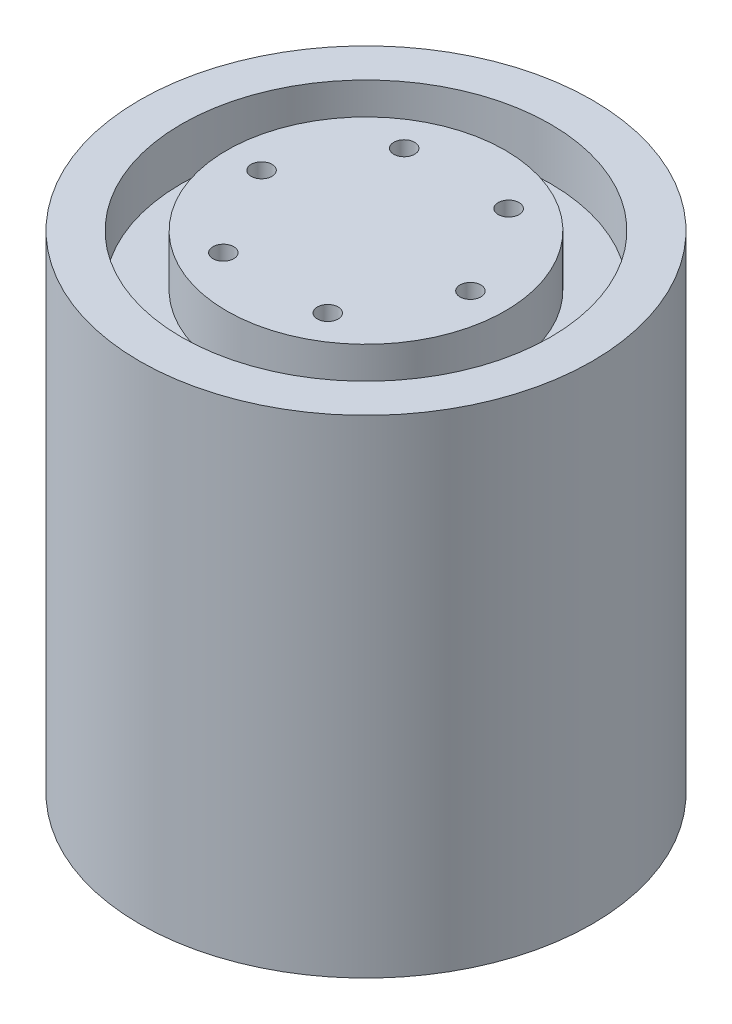
ISO-10303-21;
HEADER;
FILE_DESCRIPTION(('STEP AP214'),'2;1');
FILE_NAME('part.step','',(''),(''),'','','');
FILE_SCHEMA(('AUTOMOTIVE_DESIGN { 1 0 10303 214 1 1 1 1 }'));
ENDSEC;
DATA;
#1=APPLICATION_CONTEXT('core data for automotive mechanical design processes');
#2=APPLICATION_PROTOCOL_DEFINITION('international standard','automotive_design',2000,#1);
#3=PRODUCT_CONTEXT('',#1,'mechanical');
#4=PRODUCT('Part','Part','',(#3));
#5=PRODUCT_RELATED_PRODUCT_CATEGORY('part','',(#4));
#6=PRODUCT_DEFINITION_FORMATION('','',#4);
#7=PRODUCT_DEFINITION_CONTEXT('part definition',#1,'design');
#8=PRODUCT_DEFINITION('design','',#6,#7);
#9=PRODUCT_DEFINITION_SHAPE('','',#8);
#10=(LENGTH_UNIT() NAMED_UNIT(*) SI_UNIT(.MILLI.,.METRE.));
#11=(NAMED_UNIT(*) PLANE_ANGLE_UNIT() SI_UNIT($,.RADIAN.));
#12=(NAMED_UNIT(*) SI_UNIT($,.STERADIAN.) SOLID_ANGLE_UNIT());
#13=UNCERTAINTY_MEASURE_WITH_UNIT(LENGTH_MEASURE(1.E-05),#10,'distance_accuracy_value','');
#14=(GEOMETRIC_REPRESENTATION_CONTEXT(3) GLOBAL_UNCERTAINTY_ASSIGNED_CONTEXT((#13)) GLOBAL_UNIT_ASSIGNED_CONTEXT((#10,
#11,#12)) REPRESENTATION_CONTEXT('',''));
#15=CARTESIAN_POINT('',(0.,0.,0.));
#16=DIRECTION('',(0.,0.,1.));
#17=DIRECTION('',(1.,0.,0.));
#18=AXIS2_PLACEMENT_3D('',#15,#16,#17);
#19=CARTESIAN_POINT('',(0.,70.,0.));
#20=DIRECTION('',(0.,1.,0.));
#21=DIRECTION('',(0.,0.,1.));
#22=AXIS2_PLACEMENT_3D('',#19,#20,#21);
#23=PLANE('',#22);
#24=CARTESIAN_POINT('',(-15.,70.,-1.04744440165294E-13));
#25=DIRECTION('',(0.,1.,0.));
#26=DIRECTION('',(0.,0.,1.));
#27=AXIS2_PLACEMENT_3D('',#24,#25,#26);
#28=CIRCLE('',#27,1.5);
#29=CARTESIAN_POINT('',(-15.,70.,1.4999999999999));
#30=VERTEX_POINT('',#29);
#31=EDGE_CURVE('E53',#30,#30,#28,.T.);
#32=ORIENTED_EDGE('',*,*,#31,.F.);
#33=EDGE_LOOP('',(#32));
#34=FACE_BOUND('',#33,.T.);
#35=CARTESIAN_POINT('',(-7.50000000000006,70.,12.9903810567665));
#36=DIRECTION('',(0.,1.,0.));
#37=DIRECTION('',(0.,0.,1.));
#38=AXIS2_PLACEMENT_3D('',#35,#36,#37);
#39=CIRCLE('',#38,1.5);
#40=CARTESIAN_POINT('',(-7.50000000000006,70.,14.4903810567665));
#41=VERTEX_POINT('',#40);
#42=EDGE_CURVE('E60',#41,#41,#39,.T.);
#43=ORIENTED_EDGE('',*,*,#42,.F.);
#44=EDGE_LOOP('',(#43));
#45=FACE_BOUND('',#44,.T.);
#46=CARTESIAN_POINT('',(7.49999999999997,70.,12.9903810567666));
#47=DIRECTION('',(0.,1.,0.));
#48=DIRECTION('',(0.,0.,1.));
#49=AXIS2_PLACEMENT_3D('',#46,#47,#48);
#50=CIRCLE('',#49,1.5);
#51=CARTESIAN_POINT('',(7.49999999999997,70.,14.4903810567666));
#52=VERTEX_POINT('',#51);
#53=EDGE_CURVE('E66',#52,#52,#50,.T.);
#54=ORIENTED_EDGE('',*,*,#53,.F.);
#55=EDGE_LOOP('',(#54));
#56=FACE_BOUND('',#55,.T.);
#57=CARTESIAN_POINT('',(15.,70.,0.));
#58=DIRECTION('',(0.,1.,0.));
#59=DIRECTION('',(0.,0.,1.));
#60=AXIS2_PLACEMENT_3D('',#57,#58,#59);
#61=CIRCLE('',#60,1.5);
#62=CARTESIAN_POINT('',(15.,70.,1.5));
#63=VERTEX_POINT('',#62);
#64=EDGE_CURVE('E72',#63,#63,#61,.T.);
#65=ORIENTED_EDGE('',*,*,#64,.F.);
#66=EDGE_LOOP('',(#65));
#67=FACE_BOUND('',#66,.T.);
#68=CARTESIAN_POINT('',(7.50000000000015,70.,-12.9903810567665));
#69=DIRECTION('',(0.,1.,0.));
#70=DIRECTION('',(0.,0.,1.));
#71=AXIS2_PLACEMENT_3D('',#68,#69,#70);
#72=CIRCLE('',#71,1.5);
#73=CARTESIAN_POINT('',(7.50000000000015,70.,-11.4903810567665));
#74=VERTEX_POINT('',#73);
#75=EDGE_CURVE('E47',#74,#74,#72,.T.);
#76=ORIENTED_EDGE('',*,*,#75,.F.);
#77=EDGE_LOOP('',(#76));
#78=FACE_BOUND('',#77,.T.);
#79=CARTESIAN_POINT('',(-7.49999999999988,70.,-12.9903810567667));
#80=DIRECTION('',(0.,1.,0.));
#81=DIRECTION('',(0.,0.,1.));
#82=AXIS2_PLACEMENT_3D('',#79,#80,#81);
#83=CIRCLE('',#82,1.5);
#84=CARTESIAN_POINT('',(-7.49999999999988,70.,-11.4903810567667));
#85=VERTEX_POINT('',#84);
#86=EDGE_CURVE('E44',#85,#85,#83,.T.);
#87=ORIENTED_EDGE('',*,*,#86,.F.);
#88=EDGE_LOOP('',(#87));
#89=FACE_BOUND('',#88,.T.);
#90=CARTESIAN_POINT('',(0.,70.,0.));
#91=DIRECTION('',(0.,1.,0.));
#92=DIRECTION('',(0.,0.,1.));
#93=AXIS2_PLACEMENT_3D('',#90,#91,#92);
#94=CIRCLE('',#93,20.);
#95=CARTESIAN_POINT('',(0.,70.,20.));
#96=VERTEX_POINT('',#95);
#97=EDGE_CURVE('E84',#96,#96,#94,.T.);
#98=ORIENTED_EDGE('',*,*,#97,.T.);
#99=EDGE_LOOP('',(#98));
#100=FACE_BOUND('',#99,.T.);
#101=ADVANCED_FACE('F31',(#34,#45,#56,#67,#78,#89,#100),#23,.T.);
#102=CARTESIAN_POINT('',(-7.49999999999988,65.,-12.9903810567667));
#103=DIRECTION('',(0.,1.,0.));
#104=DIRECTION('',(0.,0.,1.));
#105=AXIS2_PLACEMENT_3D('',#102,#103,#104);
#106=CYLINDRICAL_SURFACE('',#105,1.5);
#107=CARTESIAN_POINT('',(-7.49999999999988,65.,-12.9903810567667));
#108=DIRECTION('',(0.,1.,0.));
#109=DIRECTION('',(0.,0.,1.));
#110=AXIS2_PLACEMENT_3D('',#107,#108,#109);
#111=CIRCLE('',#110,1.5);
#112=CARTESIAN_POINT('',(-7.49999999999988,65.,-11.4903810567667));
#113=VERTEX_POINT('',#112);
#114=EDGE_CURVE('E42',#113,#113,#111,.T.);
#115=ORIENTED_EDGE('',*,*,#114,.F.);
#116=EDGE_LOOP('',(#115));
#117=FACE_BOUND('',#116,.T.);
#118=ORIENTED_EDGE('',*,*,#86,.T.);
#119=EDGE_LOOP('',(#118));
#120=FACE_BOUND('',#119,.T.);
#121=ADVANCED_FACE('F118',(#117,#120),#106,.F.);
#122=CARTESIAN_POINT('',(-7.49999999999988,65.,-12.9903810567667));
#123=DIRECTION('',(0.,1.,0.));
#124=DIRECTION('',(0.,0.,1.));
#125=AXIS2_PLACEMENT_3D('',#122,#123,#124);
#126=PLANE('',#125);
#127=ORIENTED_EDGE('',*,*,#114,.T.);
#128=EDGE_LOOP('',(#127));
#129=FACE_BOUND('',#128,.T.);
#130=ADVANCED_FACE('F125',(#129),#126,.T.);
#131=CARTESIAN_POINT('',(7.50000000000015,65.,-12.9903810567665));
#132=DIRECTION('',(0.,1.,0.));
#133=DIRECTION('',(0.,0.,1.));
#134=AXIS2_PLACEMENT_3D('',#131,#132,#133);
#135=CYLINDRICAL_SURFACE('',#134,1.5);
#136=CARTESIAN_POINT('',(7.50000000000015,65.,-12.9903810567665));
#137=DIRECTION('',(0.,1.,0.));
#138=DIRECTION('',(0.,0.,1.));
#139=AXIS2_PLACEMENT_3D('',#136,#137,#138);
#140=CIRCLE('',#139,1.5);
#141=CARTESIAN_POINT('',(7.50000000000015,65.,-11.4903810567665));
#142=VERTEX_POINT('',#141);
#143=EDGE_CURVE('E75',#142,#142,#140,.T.);
#144=ORIENTED_EDGE('',*,*,#143,.F.);
#145=EDGE_LOOP('',(#144));
#146=FACE_BOUND('',#145,.T.);
#147=ORIENTED_EDGE('',*,*,#75,.T.);
#148=EDGE_LOOP('',(#147));
#149=FACE_BOUND('',#148,.T.);
#150=ADVANCED_FACE('F149',(#146,#149),#135,.F.);
#151=CARTESIAN_POINT('',(7.50000000000015,65.,-12.9903810567665));
#152=DIRECTION('',(0.,1.,0.));
#153=DIRECTION('',(0.,0.,1.));
#154=AXIS2_PLACEMENT_3D('',#151,#152,#153);
#155=PLANE('',#154);
#156=ORIENTED_EDGE('',*,*,#143,.T.);
#157=EDGE_LOOP('',(#156));
#158=FACE_BOUND('',#157,.T.);
#159=ADVANCED_FACE('F152',(#158),#155,.T.);
#160=CARTESIAN_POINT('',(15.,65.,0.));
#161=DIRECTION('',(0.,1.,0.));
#162=DIRECTION('',(0.,0.,1.));
#163=AXIS2_PLACEMENT_3D('',#160,#161,#162);
#164=CYLINDRICAL_SURFACE('',#163,1.5);
#165=CARTESIAN_POINT('',(15.,65.,0.));
#166=DIRECTION('',(0.,1.,0.));
#167=DIRECTION('',(0.,0.,1.));
#168=AXIS2_PLACEMENT_3D('',#165,#166,#167);
#169=CIRCLE('',#168,1.5);
#170=CARTESIAN_POINT('',(15.,65.,1.5));
#171=VERTEX_POINT('',#170);
#172=EDGE_CURVE('E69',#171,#171,#169,.T.);
#173=ORIENTED_EDGE('',*,*,#172,.F.);
#174=EDGE_LOOP('',(#173));
#175=FACE_BOUND('',#174,.T.);
#176=ORIENTED_EDGE('',*,*,#64,.T.);
#177=EDGE_LOOP('',(#176));
#178=FACE_BOUND('',#177,.T.);
#179=ADVANCED_FACE('F156',(#175,#178),#164,.F.);
#180=CARTESIAN_POINT('',(15.,65.,0.));
#181=DIRECTION('',(0.,1.,0.));
#182=DIRECTION('',(0.,0.,1.));
#183=AXIS2_PLACEMENT_3D('',#180,#181,#182);
#184=PLANE('',#183);
#185=ORIENTED_EDGE('',*,*,#172,.T.);
#186=EDGE_LOOP('',(#185));
#187=FACE_BOUND('',#186,.T.);
#188=ADVANCED_FACE('F160',(#187),#184,.T.);
#189=CARTESIAN_POINT('',(7.49999999999997,65.,12.9903810567666));
#190=DIRECTION('',(0.,1.,0.));
#191=DIRECTION('',(0.,0.,1.));
#192=AXIS2_PLACEMENT_3D('',#189,#190,#191);
#193=CYLINDRICAL_SURFACE('',#192,1.5);
#194=CARTESIAN_POINT('',(7.49999999999997,65.,12.9903810567666));
#195=DIRECTION('',(0.,1.,0.));
#196=DIRECTION('',(0.,0.,1.));
#197=AXIS2_PLACEMENT_3D('',#194,#195,#196);
#198=CIRCLE('',#197,1.5);
#199=CARTESIAN_POINT('',(7.49999999999997,65.,14.4903810567666));
#200=VERTEX_POINT('',#199);
#201=EDGE_CURVE('E63',#200,#200,#198,.T.);
#202=ORIENTED_EDGE('',*,*,#201,.F.);
#203=EDGE_LOOP('',(#202));
#204=FACE_BOUND('',#203,.T.);
#205=ORIENTED_EDGE('',*,*,#53,.T.);
#206=EDGE_LOOP('',(#205));
#207=FACE_BOUND('',#206,.T.);
#208=ADVANCED_FACE('F164',(#204,#207),#193,.F.);
#209=CARTESIAN_POINT('',(7.49999999999997,65.,12.9903810567666));
#210=DIRECTION('',(0.,1.,0.));
#211=DIRECTION('',(0.,0.,1.));
#212=AXIS2_PLACEMENT_3D('',#209,#210,#211);
#213=PLANE('',#212);
#214=ORIENTED_EDGE('',*,*,#201,.T.);
#215=EDGE_LOOP('',(#214));
#216=FACE_BOUND('',#215,.T.);
#217=ADVANCED_FACE('F168',(#216),#213,.T.);
#218=CARTESIAN_POINT('',(-7.50000000000006,65.,12.9903810567665));
#219=DIRECTION('',(0.,1.,0.));
#220=DIRECTION('',(0.,0.,1.));
#221=AXIS2_PLACEMENT_3D('',#218,#219,#220);
#222=CYLINDRICAL_SURFACE('',#221,1.5);
#223=CARTESIAN_POINT('',(-7.50000000000006,65.,12.9903810567665));
#224=DIRECTION('',(0.,1.,0.));
#225=DIRECTION('',(0.,0.,1.));
#226=AXIS2_PLACEMENT_3D('',#223,#224,#225);
#227=CIRCLE('',#226,1.5);
#228=CARTESIAN_POINT('',(-7.50000000000006,65.,14.4903810567665));
#229=VERTEX_POINT('',#228);
#230=EDGE_CURVE('E57',#229,#229,#227,.T.);
#231=ORIENTED_EDGE('',*,*,#230,.F.);
#232=EDGE_LOOP('',(#231));
#233=FACE_BOUND('',#232,.T.);
#234=ORIENTED_EDGE('',*,*,#42,.T.);
#235=EDGE_LOOP('',(#234));
#236=FACE_BOUND('',#235,.T.);
#237=ADVANCED_FACE('F172',(#233,#236),#222,.F.);
#238=CARTESIAN_POINT('',(-7.50000000000006,65.,12.9903810567665));
#239=DIRECTION('',(0.,1.,0.));
#240=DIRECTION('',(0.,0.,1.));
#241=AXIS2_PLACEMENT_3D('',#238,#239,#240);
#242=PLANE('',#241);
#243=ORIENTED_EDGE('',*,*,#230,.T.);
#244=EDGE_LOOP('',(#243));
#245=FACE_BOUND('',#244,.T.);
#246=ADVANCED_FACE('F176',(#245),#242,.T.);
#247=CARTESIAN_POINT('',(-15.,65.,-1.04744440165294E-13));
#248=DIRECTION('',(0.,1.,0.));
#249=DIRECTION('',(0.,0.,1.));
#250=AXIS2_PLACEMENT_3D('',#247,#248,#249);
#251=CYLINDRICAL_SURFACE('',#250,1.5);
#252=CARTESIAN_POINT('',(-15.,65.,-1.04744440165294E-13));
#253=DIRECTION('',(0.,1.,0.));
#254=DIRECTION('',(0.,0.,1.));
#255=AXIS2_PLACEMENT_3D('',#252,#253,#254);
#256=CIRCLE('',#255,1.5);
#257=CARTESIAN_POINT('',(-15.,65.,1.4999999999999));
#258=VERTEX_POINT('',#257);
#259=EDGE_CURVE('E50',#258,#258,#256,.T.);
#260=ORIENTED_EDGE('',*,*,#259,.F.);
#261=EDGE_LOOP('',(#260));
#262=FACE_BOUND('',#261,.T.);
#263=ORIENTED_EDGE('',*,*,#31,.T.);
#264=EDGE_LOOP('',(#263));
#265=FACE_BOUND('',#264,.T.);
#266=ADVANCED_FACE('F145',(#262,#265),#251,.F.);
#267=CARTESIAN_POINT('',(-15.,65.,-1.04744440165294E-13));
#268=DIRECTION('',(0.,1.,0.));
#269=DIRECTION('',(0.,0.,1.));
#270=AXIS2_PLACEMENT_3D('',#267,#268,#269);
#271=PLANE('',#270);
#272=ORIENTED_EDGE('',*,*,#259,.T.);
#273=EDGE_LOOP('',(#272));
#274=FACE_BOUND('',#273,.T.);
#275=ADVANCED_FACE('F141',(#274),#271,.T.);
#276=CARTESIAN_POINT('',(0.,62.6,0.));
#277=DIRECTION('',(0.,1.,0.));
#278=DIRECTION('',(0.,0.,1.));
#279=AXIS2_PLACEMENT_3D('',#276,#277,#278);
#280=CYLINDRICAL_SURFACE('',#279,20.);
#281=CARTESIAN_POINT('',(0.,62.6,0.));
#282=DIRECTION('',(0.,1.,0.));
#283=DIRECTION('',(0.,0.,1.));
#284=AXIS2_PLACEMENT_3D('',#281,#282,#283);
#285=CIRCLE('',#284,20.);
#286=CARTESIAN_POINT('',(0.,62.6,20.));
#287=VERTEX_POINT('',#286);
#288=EDGE_CURVE('E83',#287,#287,#285,.T.);
#289=ORIENTED_EDGE('',*,*,#288,.T.);
#290=EDGE_LOOP('',(#289));
#291=FACE_BOUND('',#290,.T.);
#292=ORIENTED_EDGE('',*,*,#97,.F.);
#293=EDGE_LOOP('',(#292));
#294=FACE_BOUND('',#293,.T.);
#295=ADVANCED_FACE('F92',(#291,#294),#280,.T.);
#296=CARTESIAN_POINT('',(0.,62.6,0.));
#297=DIRECTION('',(0.,1.,0.));
#298=DIRECTION('',(0.,0.,1.));
#299=AXIS2_PLACEMENT_3D('',#296,#297,#298);
#300=CYLINDRICAL_SURFACE('',#299,26.5);
#301=CARTESIAN_POINT('',(0.,62.6,0.));
#302=DIRECTION('',(0.,1.,0.));
#303=DIRECTION('',(0.,0.,1.));
#304=AXIS2_PLACEMENT_3D('',#301,#302,#303);
#305=CIRCLE('',#304,26.5);
#306=CARTESIAN_POINT('',(0.,62.6,26.5));
#307=VERTEX_POINT('',#306);
#308=EDGE_CURVE('E54',#307,#307,#305,.T.);
#309=ORIENTED_EDGE('',*,*,#308,.F.);
#310=EDGE_LOOP('',(#309));
#311=FACE_BOUND('',#310,.T.);
#312=CARTESIAN_POINT('',(0.,70.,0.));
#313=DIRECTION('',(0.,1.,0.));
#314=DIRECTION('',(0.,0.,1.));
#315=AXIS2_PLACEMENT_3D('',#312,#313,#314);
#316=CIRCLE('',#315,26.5);
#317=CARTESIAN_POINT('',(0.,70.,26.5));
#318=VERTEX_POINT('',#317);
#319=EDGE_CURVE('E80',#318,#318,#316,.T.);
#320=ORIENTED_EDGE('',*,*,#319,.T.);
#321=EDGE_LOOP('',(#320));
#322=FACE_BOUND('',#321,.T.);
#323=ADVANCED_FACE('F99',(#311,#322),#300,.F.);
#324=CARTESIAN_POINT('',(0.,62.6,0.));
#325=DIRECTION('',(0.,1.,0.));
#326=DIRECTION('',(0.,0.,1.));
#327=AXIS2_PLACEMENT_3D('',#324,#325,#326);
#328=PLANE('',#327);
#329=ORIENTED_EDGE('',*,*,#288,.F.);
#330=EDGE_LOOP('',(#329));
#331=FACE_BOUND('',#330,.T.);
#332=ORIENTED_EDGE('',*,*,#308,.T.);
#333=EDGE_LOOP('',(#332));
#334=FACE_BOUND('',#333,.T.);
#335=ADVANCED_FACE('F95',(#331,#334),#328,.T.);
#336=CARTESIAN_POINT('',(0.,0.,0.));
#337=DIRECTION('',(0.,1.,0.));
#338=DIRECTION('',(0.,0.,1.));
#339=AXIS2_PLACEMENT_3D('',#336,#337,#338);
#340=PLANE('',#339);
#341=CARTESIAN_POINT('',(0.,0.,0.));
#342=DIRECTION('',(0.,1.,0.));
#343=DIRECTION('',(0.,0.,1.));
#344=AXIS2_PLACEMENT_3D('',#341,#342,#343);
#345=CIRCLE('',#344,32.5);
#346=CARTESIAN_POINT('',(0.,0.,32.5));
#347=VERTEX_POINT('',#346);
#348=EDGE_CURVE('E35',#347,#347,#345,.T.);
#349=ORIENTED_EDGE('',*,*,#348,.F.);
#350=EDGE_LOOP('',(#349));
#351=FACE_BOUND('',#350,.T.);
#352=ADVANCED_FACE('F98',(#351),#340,.F.);
#353=CARTESIAN_POINT('',(0.,70.,0.));
#354=DIRECTION('',(0.,-1.,0.));
#355=DIRECTION('',(0.,0.,-1.));
#356=AXIS2_PLACEMENT_3D('',#353,#354,#355);
#357=CYLINDRICAL_SURFACE('',#356,32.5);
#358=CARTESIAN_POINT('',(0.,70.,0.));
#359=DIRECTION('',(0.,1.,0.));
#360=DIRECTION('',(0.,0.,1.));
#361=AXIS2_PLACEMENT_3D('',#358,#359,#360);
#362=CIRCLE('',#361,32.5);
#363=CARTESIAN_POINT('',(0.,70.,32.5));
#364=VERTEX_POINT('',#363);
#365=EDGE_CURVE('E10',#364,#364,#362,.T.);
#366=ORIENTED_EDGE('',*,*,#365,.F.);
#367=EDGE_LOOP('',(#366));
#368=FACE_BOUND('',#367,.T.);
#369=ORIENTED_EDGE('',*,*,#348,.T.);
#370=EDGE_LOOP('',(#369));
#371=FACE_BOUND('',#370,.T.);
#372=ADVANCED_FACE('F33',(#368,#371),#357,.T.);
#373=ORIENTED_EDGE('',*,*,#319,.F.);
#374=EDGE_LOOP('',(#373));
#375=FACE_BOUND('',#374,.T.);
#376=ORIENTED_EDGE('',*,*,#365,.T.);
#377=EDGE_LOOP('',(#376));
#378=FACE_BOUND('',#377,.T.);
#379=ADVANCED_FACE('F108',(#375,#378),#23,.T.);
#380=CLOSED_SHELL('',(#101,#121,#130,#150,#159,#179,#188,#208,#217,#237,#246,#266,#275,#295,
#323,#335,#352,#372,#379));
#381=MANIFOLD_SOLID_BREP('B2',#380);
#382=ADVANCED_BREP_SHAPE_REPRESENTATION('',(#18,#381),#14);
#383=SHAPE_DEFINITION_REPRESENTATION(#9,#382);
ENDSEC;
END-ISO-10303-21;
